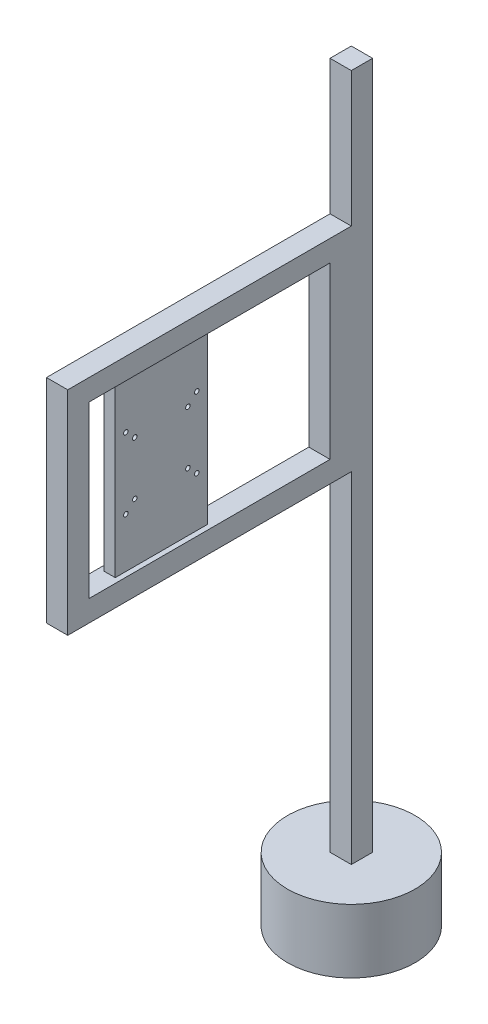
ISO-10303-21;
HEADER;
FILE_DESCRIPTION(('STEP AP214'),'2;1');
FILE_NAME('part.step','',(''),(''),'','','');
FILE_SCHEMA(('AUTOMOTIVE_DESIGN { 1 0 10303 214 1 1 1 1 }'));
ENDSEC;
DATA;
#1=APPLICATION_CONTEXT('core data for automotive mechanical design processes');
#2=APPLICATION_PROTOCOL_DEFINITION('international standard','automotive_design',2000,#1);
#3=PRODUCT_CONTEXT('',#1,'mechanical');
#4=PRODUCT('Part','Part','',(#3));
#5=PRODUCT_RELATED_PRODUCT_CATEGORY('part','',(#4));
#6=PRODUCT_DEFINITION_FORMATION('','',#4);
#7=PRODUCT_DEFINITION_CONTEXT('part definition',#1,'design');
#8=PRODUCT_DEFINITION('design','',#6,#7);
#9=PRODUCT_DEFINITION_SHAPE('','',#8);
#10=(LENGTH_UNIT() NAMED_UNIT(*) SI_UNIT(.MILLI.,.METRE.));
#11=(NAMED_UNIT(*) PLANE_ANGLE_UNIT() SI_UNIT($,.RADIAN.));
#12=(NAMED_UNIT(*) SI_UNIT($,.STERADIAN.) SOLID_ANGLE_UNIT());
#13=UNCERTAINTY_MEASURE_WITH_UNIT(LENGTH_MEASURE(1.E-05),#10,'distance_accuracy_value','');
#14=(GEOMETRIC_REPRESENTATION_CONTEXT(3) GLOBAL_UNCERTAINTY_ASSIGNED_CONTEXT((#13)) GLOBAL_UNIT_ASSIGNED_CONTEXT((#10,
#11,#12)) REPRESENTATION_CONTEXT('',''));
#15=CARTESIAN_POINT('',(0.,0.,0.));
#16=DIRECTION('',(0.,0.,1.));
#17=DIRECTION('',(1.,0.,0.));
#18=AXIS2_PLACEMENT_3D('',#15,#16,#17);
#19=CARTESIAN_POINT('',(15.,840.,341.));
#20=DIRECTION('',(0.,0.,1.));
#21=DIRECTION('',(0.,-1.,0.));
#22=AXIS2_PLACEMENT_3D('',#19,#20,#21);
#23=PLANE('',#22);
#24=DIRECTION('',(-1.,0.,0.));
#25=VECTOR('',#24,1.);
#26=CARTESIAN_POINT('',(15.,600.,341.));
#27=LINE('',#26,#25);
#28=CARTESIAN_POINT('',(8.,600.,341.));
#29=VERTEX_POINT('',#28);
#30=CARTESIAN_POINT('',(-8.,600.,341.));
#31=VERTEX_POINT('',#30);
#32=EDGE_CURVE('E181',#29,#31,#27,.T.);
#33=ORIENTED_EDGE('',*,*,#32,.F.);
#34=DIRECTION('',(0.,-1.,0.));
#35=VECTOR('',#34,1.);
#36=CARTESIAN_POINT('',(8.,840.,341.));
#37=LINE('',#36,#35);
#38=CARTESIAN_POINT('',(8.,840.,341.));
#39=VERTEX_POINT('',#38);
#40=EDGE_CURVE('E187',#39,#29,#37,.T.);
#41=ORIENTED_EDGE('',*,*,#40,.F.);
#42=DIRECTION('',(-1.,0.,0.));
#43=VECTOR('',#42,1.);
#44=CARTESIAN_POINT('',(15.,840.,341.));
#45=LINE('',#44,#43);
#46=CARTESIAN_POINT('',(-8.,840.,341.));
#47=VERTEX_POINT('',#46);
#48=EDGE_CURVE('E207',#39,#47,#45,.T.);
#49=ORIENTED_EDGE('',*,*,#48,.T.);
#50=DIRECTION('',(0.,1.,0.));
#51=VECTOR('',#50,1.);
#52=CARTESIAN_POINT('',(-8.,840.,341.));
#53=LINE('',#52,#51);
#54=EDGE_CURVE('E196',#31,#47,#53,.T.);
#55=ORIENTED_EDGE('',*,*,#54,.F.);
#56=EDGE_LOOP('',(#33,#41,#49,#55));
#57=FACE_BOUND('',#56,.T.);
#58=ADVANCED_FACE('F32',(#57),#23,.T.);
#59=CARTESIAN_POINT('',(15.,840.,211.));
#60=DIRECTION('',(0.,0.,-1.));
#61=DIRECTION('',(0.,1.,0.));
#62=AXIS2_PLACEMENT_3D('',#59,#60,#61);
#63=PLANE('',#62);
#64=DIRECTION('',(-1.,0.,0.));
#65=VECTOR('',#64,1.);
#66=CARTESIAN_POINT('',(15.,840.,211.));
#67=LINE('',#66,#65);
#68=CARTESIAN_POINT('',(8.,840.,211.));
#69=VERTEX_POINT('',#68);
#70=CARTESIAN_POINT('',(-8.,840.,211.));
#71=VERTEX_POINT('',#70);
#72=EDGE_CURVE('E53',#69,#71,#67,.T.);
#73=ORIENTED_EDGE('',*,*,#72,.F.);
#74=DIRECTION('',(0.,1.,0.));
#75=VECTOR('',#74,1.);
#76=CARTESIAN_POINT('',(8.,840.,211.));
#77=LINE('',#76,#75);
#78=CARTESIAN_POINT('',(8.,600.,211.));
#79=VERTEX_POINT('',#78);
#80=EDGE_CURVE('E186',#79,#69,#77,.T.);
#81=ORIENTED_EDGE('',*,*,#80,.F.);
#82=DIRECTION('',(-1.,0.,0.));
#83=VECTOR('',#82,1.);
#84=CARTESIAN_POINT('',(15.,600.,211.));
#85=LINE('',#84,#83);
#86=CARTESIAN_POINT('',(-8.,600.,211.));
#87=VERTEX_POINT('',#86);
#88=EDGE_CURVE('E183',#79,#87,#85,.T.);
#89=ORIENTED_EDGE('',*,*,#88,.T.);
#90=DIRECTION('',(0.,-1.,0.));
#91=VECTOR('',#90,1.);
#92=CARTESIAN_POINT('',(-8.,840.,211.));
#93=LINE('',#92,#91);
#94=EDGE_CURVE('E757',#71,#87,#93,.T.);
#95=ORIENTED_EDGE('',*,*,#94,.F.);
#96=EDGE_LOOP('',(#73,#81,#89,#95));
#97=FACE_BOUND('',#96,.T.);
#98=ADVANCED_FACE('F405',(#97),#63,.T.);
#99=CARTESIAN_POINT('',(15.,757.5,313.5));
#100=DIRECTION('',(-1.,0.,0.));
#101=DIRECTION('',(0.,0.,1.));
#102=AXIS2_PLACEMENT_3D('',#99,#100,#101);
#103=CYLINDRICAL_SURFACE('',#102,3.17499999999997);
#104=CARTESIAN_POINT('',(-8.,757.5,313.5));
#105=DIRECTION('',(-1.,0.,0.));
#106=DIRECTION('',(0.,0.,1.));
#107=AXIS2_PLACEMENT_3D('',#104,#105,#106);
#108=CIRCLE('',#107,3.17499999999997);
#109=CARTESIAN_POINT('',(-8.,757.5,316.675));
#110=VERTEX_POINT('',#109);
#111=EDGE_CURVE('E203',#110,#110,#108,.F.);
#112=ORIENTED_EDGE('',*,*,#111,.F.);
#113=EDGE_LOOP('',(#112));
#114=FACE_BOUND('',#113,.T.);
#115=CARTESIAN_POINT('',(8.,757.5,313.5));
#116=DIRECTION('',(1.,0.,0.));
#117=DIRECTION('',(0.,0.,-1.));
#118=AXIS2_PLACEMENT_3D('',#115,#116,#117);
#119=CIRCLE('',#118,3.17499999999997);
#120=CARTESIAN_POINT('',(8.,757.5,310.325));
#121=VERTEX_POINT('',#120);
#122=EDGE_CURVE('E754',#121,#121,#119,.F.);
#123=ORIENTED_EDGE('',*,*,#122,.F.);
#124=EDGE_LOOP('',(#123));
#125=FACE_BOUND('',#124,.T.);
#126=ADVANCED_FACE('F410',(#114,#125),#103,.F.);
#127=CARTESIAN_POINT('',(15.,757.5,238.5));
#128=DIRECTION('',(-1.,0.,0.));
#129=DIRECTION('',(0.,0.,1.));
#130=AXIS2_PLACEMENT_3D('',#127,#128,#129);
#131=CYLINDRICAL_SURFACE('',#130,3.17499999999997);
#132=CARTESIAN_POINT('',(-8.,757.5,238.5));
#133=DIRECTION('',(-1.,0.,0.));
#134=DIRECTION('',(0.,0.,1.));
#135=AXIS2_PLACEMENT_3D('',#132,#133,#134);
#136=CIRCLE('',#135,3.17499999999997);
#137=CARTESIAN_POINT('',(-8.,757.5,241.675));
#138=VERTEX_POINT('',#137);
#139=EDGE_CURVE('E779',#138,#138,#136,.F.);
#140=ORIENTED_EDGE('',*,*,#139,.F.);
#141=EDGE_LOOP('',(#140));
#142=FACE_BOUND('',#141,.T.);
#143=CARTESIAN_POINT('',(8.,757.5,238.5));
#144=DIRECTION('',(1.,0.,0.));
#145=DIRECTION('',(0.,0.,-1.));
#146=AXIS2_PLACEMENT_3D('',#143,#144,#145);
#147=CIRCLE('',#146,3.17499999999997);
#148=CARTESIAN_POINT('',(8.,757.5,235.325));
#149=VERTEX_POINT('',#148);
#150=EDGE_CURVE('E751',#149,#149,#147,.F.);
#151=ORIENTED_EDGE('',*,*,#150,.F.);
#152=EDGE_LOOP('',(#151));
#153=FACE_BOUND('',#152,.T.);
#154=ADVANCED_FACE('F499',(#142,#153),#131,.F.);
#155=CARTESIAN_POINT('',(15.,682.5,238.5));
#156=DIRECTION('',(-1.,0.,0.));
#157=DIRECTION('',(0.,0.,1.));
#158=AXIS2_PLACEMENT_3D('',#155,#156,#157);
#159=CYLINDRICAL_SURFACE('',#158,3.17499999999997);
#160=CARTESIAN_POINT('',(-8.,682.5,238.5));
#161=DIRECTION('',(-1.,0.,0.));
#162=DIRECTION('',(0.,0.,1.));
#163=AXIS2_PLACEMENT_3D('',#160,#161,#162);
#164=CIRCLE('',#163,3.17499999999997);
#165=CARTESIAN_POINT('',(-8.,682.5,241.675));
#166=VERTEX_POINT('',#165);
#167=EDGE_CURVE('E777',#166,#166,#164,.F.);
#168=ORIENTED_EDGE('',*,*,#167,.F.);
#169=EDGE_LOOP('',(#168));
#170=FACE_BOUND('',#169,.T.);
#171=CARTESIAN_POINT('',(8.,682.5,238.5));
#172=DIRECTION('',(1.,0.,0.));
#173=DIRECTION('',(0.,0.,-1.));
#174=AXIS2_PLACEMENT_3D('',#171,#172,#173);
#175=CIRCLE('',#174,3.17499999999997);
#176=CARTESIAN_POINT('',(8.,682.5,235.325));
#177=VERTEX_POINT('',#176);
#178=EDGE_CURVE('E748',#177,#177,#175,.F.);
#179=ORIENTED_EDGE('',*,*,#178,.F.);
#180=EDGE_LOOP('',(#179));
#181=FACE_BOUND('',#180,.T.);
#182=ADVANCED_FACE('F507',(#170,#181),#159,.F.);
#183=CARTESIAN_POINT('',(15.,682.5,313.5));
#184=DIRECTION('',(-1.,0.,0.));
#185=DIRECTION('',(0.,0.,1.));
#186=AXIS2_PLACEMENT_3D('',#183,#184,#185);
#187=CYLINDRICAL_SURFACE('',#186,3.17499999999997);
#188=CARTESIAN_POINT('',(-8.,682.5,313.5));
#189=DIRECTION('',(-1.,0.,0.));
#190=DIRECTION('',(0.,0.,1.));
#191=AXIS2_PLACEMENT_3D('',#188,#189,#190);
#192=CIRCLE('',#191,3.17499999999997);
#193=CARTESIAN_POINT('',(-8.,682.5,316.675));
#194=VERTEX_POINT('',#193);
#195=EDGE_CURVE('E774',#194,#194,#192,.F.);
#196=ORIENTED_EDGE('',*,*,#195,.F.);
#197=EDGE_LOOP('',(#196));
#198=FACE_BOUND('',#197,.T.);
#199=CARTESIAN_POINT('',(8.,682.5,313.5));
#200=DIRECTION('',(1.,0.,0.));
#201=DIRECTION('',(0.,0.,-1.));
#202=AXIS2_PLACEMENT_3D('',#199,#200,#201);
#203=CIRCLE('',#202,3.17499999999997);
#204=CARTESIAN_POINT('',(8.,682.5,310.325));
#205=VERTEX_POINT('',#204);
#206=EDGE_CURVE('E745',#205,#205,#203,.F.);
#207=ORIENTED_EDGE('',*,*,#206,.F.);
#208=EDGE_LOOP('',(#207));
#209=FACE_BOUND('',#208,.T.);
#210=ADVANCED_FACE('F516',(#198,#209),#187,.F.);
#211=CARTESIAN_POINT('',(15.,770.,326.));
#212=DIRECTION('',(-1.,0.,0.));
#213=DIRECTION('',(0.,0.,1.));
#214=AXIS2_PLACEMENT_3D('',#211,#212,#213);
#215=CYLINDRICAL_SURFACE('',#214,3.17499999999997);
#216=CARTESIAN_POINT('',(-8.,770.,326.));
#217=DIRECTION('',(-1.,0.,0.));
#218=DIRECTION('',(0.,0.,1.));
#219=AXIS2_PLACEMENT_3D('',#216,#217,#218);
#220=CIRCLE('',#219,3.17499999999997);
#221=CARTESIAN_POINT('',(-8.,770.,329.175));
#222=VERTEX_POINT('',#221);
#223=EDGE_CURVE('E771',#222,#222,#220,.F.);
#224=ORIENTED_EDGE('',*,*,#223,.F.);
#225=EDGE_LOOP('',(#224));
#226=FACE_BOUND('',#225,.T.);
#227=CARTESIAN_POINT('',(8.,770.,326.));
#228=DIRECTION('',(1.,0.,0.));
#229=DIRECTION('',(0.,0.,-1.));
#230=AXIS2_PLACEMENT_3D('',#227,#228,#229);
#231=CIRCLE('',#230,3.17499999999997);
#232=CARTESIAN_POINT('',(8.,770.,322.825));
#233=VERTEX_POINT('',#232);
#234=EDGE_CURVE('E742',#233,#233,#231,.F.);
#235=ORIENTED_EDGE('',*,*,#234,.F.);
#236=EDGE_LOOP('',(#235));
#237=FACE_BOUND('',#236,.T.);
#238=ADVANCED_FACE('F525',(#226,#237),#215,.F.);
#239=CARTESIAN_POINT('',(15.,770.,226.));
#240=DIRECTION('',(-1.,0.,0.));
#241=DIRECTION('',(0.,0.,1.));
#242=AXIS2_PLACEMENT_3D('',#239,#240,#241);
#243=CYLINDRICAL_SURFACE('',#242,3.17499999999997);
#244=CARTESIAN_POINT('',(-8.,770.,226.));
#245=DIRECTION('',(-1.,0.,0.));
#246=DIRECTION('',(0.,0.,1.));
#247=AXIS2_PLACEMENT_3D('',#244,#245,#246);
#248=CIRCLE('',#247,3.17499999999997);
#249=CARTESIAN_POINT('',(-8.,770.,229.175));
#250=VERTEX_POINT('',#249);
#251=EDGE_CURVE('E768',#250,#250,#248,.F.);
#252=ORIENTED_EDGE('',*,*,#251,.F.);
#253=EDGE_LOOP('',(#252));
#254=FACE_BOUND('',#253,.T.);
#255=CARTESIAN_POINT('',(8.,770.,226.));
#256=DIRECTION('',(1.,0.,0.));
#257=DIRECTION('',(0.,0.,-1.));
#258=AXIS2_PLACEMENT_3D('',#255,#256,#257);
#259=CIRCLE('',#258,3.17499999999997);
#260=CARTESIAN_POINT('',(8.,770.,222.825));
#261=VERTEX_POINT('',#260);
#262=EDGE_CURVE('E735',#261,#261,#259,.F.);
#263=ORIENTED_EDGE('',*,*,#262,.F.);
#264=EDGE_LOOP('',(#263));
#265=FACE_BOUND('',#264,.T.);
#266=ADVANCED_FACE('F534',(#254,#265),#243,.F.);
#267=CARTESIAN_POINT('',(15.,670.,326.));
#268=DIRECTION('',(-1.,0.,0.));
#269=DIRECTION('',(0.,0.,1.));
#270=AXIS2_PLACEMENT_3D('',#267,#268,#269);
#271=CYLINDRICAL_SURFACE('',#270,3.17499999999997);
#272=CARTESIAN_POINT('',(-8.,670.,326.));
#273=DIRECTION('',(-1.,0.,0.));
#274=DIRECTION('',(0.,0.,1.));
#275=AXIS2_PLACEMENT_3D('',#272,#273,#274);
#276=CIRCLE('',#275,3.17499999999997);
#277=CARTESIAN_POINT('',(-8.,670.,329.175));
#278=VERTEX_POINT('',#277);
#279=EDGE_CURVE('E765',#278,#278,#276,.F.);
#280=ORIENTED_EDGE('',*,*,#279,.F.);
#281=EDGE_LOOP('',(#280));
#282=FACE_BOUND('',#281,.T.);
#283=CARTESIAN_POINT('',(8.,670.,326.));
#284=DIRECTION('',(1.,0.,0.));
#285=DIRECTION('',(0.,0.,-1.));
#286=AXIS2_PLACEMENT_3D('',#283,#284,#285);
#287=CIRCLE('',#286,3.17499999999997);
#288=CARTESIAN_POINT('',(8.,670.,322.825));
#289=VERTEX_POINT('',#288);
#290=EDGE_CURVE('E732',#289,#289,#287,.F.);
#291=ORIENTED_EDGE('',*,*,#290,.F.);
#292=EDGE_LOOP('',(#291));
#293=FACE_BOUND('',#292,.T.);
#294=ADVANCED_FACE('F543',(#282,#293),#271,.F.);
#295=CARTESIAN_POINT('',(15.,670.,226.));
#296=DIRECTION('',(-1.,0.,0.));
#297=DIRECTION('',(0.,0.,1.));
#298=AXIS2_PLACEMENT_3D('',#295,#296,#297);
#299=CYLINDRICAL_SURFACE('',#298,3.17499999999997);
#300=CARTESIAN_POINT('',(-8.,670.,226.));
#301=DIRECTION('',(-1.,0.,0.));
#302=DIRECTION('',(0.,0.,1.));
#303=AXIS2_PLACEMENT_3D('',#300,#301,#302);
#304=CIRCLE('',#303,3.17499999999997);
#305=CARTESIAN_POINT('',(-8.,670.,229.175));
#306=VERTEX_POINT('',#305);
#307=EDGE_CURVE('E36',#306,#306,#304,.F.);
#308=ORIENTED_EDGE('',*,*,#307,.F.);
#309=EDGE_LOOP('',(#308));
#310=FACE_BOUND('',#309,.T.);
#311=CARTESIAN_POINT('',(8.,670.,226.));
#312=DIRECTION('',(1.,0.,0.));
#313=DIRECTION('',(0.,0.,-1.));
#314=AXIS2_PLACEMENT_3D('',#311,#312,#313);
#315=CIRCLE('',#314,3.17499999999997);
#316=CARTESIAN_POINT('',(8.,670.,222.825));
#317=VERTEX_POINT('',#316);
#318=EDGE_CURVE('E730',#317,#317,#315,.F.);
#319=ORIENTED_EDGE('',*,*,#318,.F.);
#320=EDGE_LOOP('',(#319));
#321=FACE_BOUND('',#320,.T.);
#322=ADVANCED_FACE('F552',(#310,#321),#299,.F.);
#323=CARTESIAN_POINT('',(-15.,1060.,15.));
#324=DIRECTION('',(0.,0.,-1.));
#325=DIRECTION('',(-1.,0.,0.));
#326=AXIS2_PLACEMENT_3D('',#323,#324,#325);
#327=PLANE('',#326);
#328=DIRECTION('',(0.,-1.,0.));
#329=VECTOR('',#328,1.);
#330=CARTESIAN_POINT('',(15.,1060.,15.));
#331=LINE('',#330,#329);
#332=CARTESIAN_POINT('',(15.,570.,15.));
#333=VERTEX_POINT('',#332);
#334=CARTESIAN_POINT('',(15.,90.,15.));
#335=VERTEX_POINT('',#334);
#336=EDGE_CURVE('E300',#333,#335,#331,.T.);
#337=ORIENTED_EDGE('',*,*,#336,.F.);
#338=DIRECTION('',(1.,0.,0.));
#339=VECTOR('',#338,1.);
#340=CARTESIAN_POINT('',(-15.,570.,15.));
#341=LINE('',#340,#339);
#342=CARTESIAN_POINT('',(-15.,570.,15.));
#343=VERTEX_POINT('',#342);
#344=EDGE_CURVE('E253',#343,#333,#341,.T.);
#345=ORIENTED_EDGE('',*,*,#344,.F.);
#346=DIRECTION('',(0.,-1.,0.));
#347=VECTOR('',#346,1.);
#348=CARTESIAN_POINT('',(-15.,1060.,15.));
#349=LINE('',#348,#347);
#350=CARTESIAN_POINT('',(-15.,90.,15.));
#351=VERTEX_POINT('',#350);
#352=EDGE_CURVE('E314',#343,#351,#349,.T.);
#353=ORIENTED_EDGE('',*,*,#352,.T.);
#354=DIRECTION('',(1.,0.,0.));
#355=VECTOR('',#354,1.);
#356=CARTESIAN_POINT('',(-15.,90.,15.));
#357=LINE('',#356,#355);
#358=EDGE_CURVE('E294',#351,#335,#357,.T.);
#359=ORIENTED_EDGE('',*,*,#358,.T.);
#360=EDGE_LOOP('',(#337,#345,#353,#359));
#361=FACE_BOUND('',#360,.T.);
#362=ADVANCED_FACE('F368',(#361),#327,.F.);
#363=CARTESIAN_POINT('',(-15.,1060.,-15.));
#364=DIRECTION('',(0.,0.,1.));
#365=DIRECTION('',(1.,0.,0.));
#366=AXIS2_PLACEMENT_3D('',#363,#364,#365);
#367=PLANE('',#366);
#368=DIRECTION('',(1.,0.,0.));
#369=VECTOR('',#368,1.);
#370=CARTESIAN_POINT('',(-15.,210.,-15.));
#371=LINE('',#370,#369);
#372=CARTESIAN_POINT('',(-15.,210.,-15.));
#373=VERTEX_POINT('',#372);
#374=CARTESIAN_POINT('',(6.21320343559641,210.,-15.));
#375=VERTEX_POINT('',#374);
#376=EDGE_CURVE('E286',#373,#375,#371,.T.);
#377=ORIENTED_EDGE('',*,*,#376,.F.);
#378=DIRECTION('',(0.,-1.,0.));
#379=VECTOR('',#378,1.);
#380=CARTESIAN_POINT('',(-15.,1060.,-15.));
#381=LINE('',#380,#379);
#382=CARTESIAN_POINT('',(-15.,1060.,-15.));
#383=VERTEX_POINT('',#382);
#384=EDGE_CURVE('E319',#383,#373,#381,.T.);
#385=ORIENTED_EDGE('',*,*,#384,.F.);
#386=DIRECTION('',(-1.,0.,0.));
#387=VECTOR('',#386,1.);
#388=CARTESIAN_POINT('',(-15.,1060.,-15.));
#389=LINE('',#388,#387);
#390=CARTESIAN_POINT('',(15.,1060.,-15.));
#391=VERTEX_POINT('',#390);
#392=EDGE_CURVE('E293',#391,#383,#389,.T.);
#393=ORIENTED_EDGE('',*,*,#392,.F.);
#394=DIRECTION('',(0.,-1.,0.));
#395=VECTOR('',#394,1.);
#396=CARTESIAN_POINT('',(15.,1060.,-15.));
#397=LINE('',#396,#395);
#398=CARTESIAN_POINT('',(15.,90.,-15.));
#399=VERTEX_POINT('',#398);
#400=EDGE_CURVE('E322',#391,#399,#397,.T.);
#401=ORIENTED_EDGE('',*,*,#400,.T.);
#402=DIRECTION('',(-1.,0.,0.));
#403=VECTOR('',#402,1.);
#404=CARTESIAN_POINT('',(-15.,90.,-15.));
#405=LINE('',#404,#403);
#406=CARTESIAN_POINT('',(-15.,90.,-15.));
#407=VERTEX_POINT('',#406);
#408=EDGE_CURVE('E303',#399,#407,#405,.T.);
#409=ORIENTED_EDGE('',*,*,#408,.T.);
#410=CARTESIAN_POINT('',(-15.,180.,-15.));
#411=VERTEX_POINT('',#410);
#412=EDGE_CURVE('E318',#411,#407,#381,.T.);
#413=ORIENTED_EDGE('',*,*,#412,.F.);
#414=DIRECTION('',(-1.,0.,0.));
#415=VECTOR('',#414,1.);
#416=CARTESIAN_POINT('',(-15.,180.,-15.));
#417=LINE('',#416,#415);
#418=CARTESIAN_POINT('',(6.21320343559642,180.,-15.));
#419=VERTEX_POINT('',#418);
#420=EDGE_CURVE('E283',#419,#411,#417,.T.);
#421=ORIENTED_EDGE('',*,*,#420,.F.);
#422=DIRECTION('',(0.,-1.,0.));
#423=VECTOR('',#422,1.);
#424=CARTESIAN_POINT('',(6.21320343559641,1060.,-15.));
#425=LINE('',#424,#423);
#426=EDGE_CURVE('E11',#375,#419,#425,.T.);
#427=ORIENTED_EDGE('',*,*,#426,.F.);
#428=EDGE_LOOP('',(#377,#385,#393,#401,#409,#413,#421,#427));
#429=FACE_BOUND('',#428,.T.);
#430=ADVANCED_FACE('F354',(#429),#367,.F.);
#431=CARTESIAN_POINT('',(-15.,1060.,15.));
#432=DIRECTION('',(1.,0.,0.));
#433=DIRECTION('',(0.,0.,-1.));
#434=AXIS2_PLACEMENT_3D('',#431,#432,#433);
#435=PLANE('',#434);
#436=DIRECTION('',(0.,0.,1.));
#437=VECTOR('',#436,1.);
#438=CARTESIAN_POINT('',(-15.,840.,45.));
#439=LINE('',#438,#437);
#440=CARTESIAN_POINT('',(-15.,840.,45.));
#441=VERTEX_POINT('',#440);
#442=CARTESIAN_POINT('',(-15.,840.,385.));
#443=VERTEX_POINT('',#442);
#444=EDGE_CURVE('E212',#441,#443,#439,.T.);
#445=ORIENTED_EDGE('',*,*,#444,.T.);
#446=DIRECTION('',(0.,-1.,0.));
#447=VECTOR('',#446,1.);
#448=CARTESIAN_POINT('',(-15.,840.,385.));
#449=LINE('',#448,#447);
#450=CARTESIAN_POINT('',(-15.,600.,385.));
#451=VERTEX_POINT('',#450);
#452=EDGE_CURVE('E215',#443,#451,#449,.T.);
#453=ORIENTED_EDGE('',*,*,#452,.T.);
#454=DIRECTION('',(0.,0.,-1.));
#455=VECTOR('',#454,1.);
#456=CARTESIAN_POINT('',(-15.,600.,45.));
#457=LINE('',#456,#455);
#458=CARTESIAN_POINT('',(-15.,600.,45.));
#459=VERTEX_POINT('',#458);
#460=EDGE_CURVE('E218',#451,#459,#457,.T.);
#461=ORIENTED_EDGE('',*,*,#460,.T.);
#462=DIRECTION('',(0.,1.,0.));
#463=VECTOR('',#462,1.);
#464=CARTESIAN_POINT('',(-15.,840.,45.));
#465=LINE('',#464,#463);
#466=EDGE_CURVE('E209',#459,#441,#465,.T.);
#467=ORIENTED_EDGE('',*,*,#466,.T.);
#468=EDGE_LOOP('',(#445,#453,#461,#467));
#469=FACE_BOUND('',#468,.T.);
#470=DIRECTION('',(0.,0.,-1.));
#471=VECTOR('',#470,1.);
#472=CARTESIAN_POINT('',(-15.,210.,15.));
#473=LINE('',#472,#471);
#474=CARTESIAN_POINT('',(-15.,210.,6.21320343559638));
#475=VERTEX_POINT('',#474);
#476=EDGE_CURVE('E41',#475,#373,#473,.T.);
#477=ORIENTED_EDGE('',*,*,#476,.F.);
#478=DIRECTION('',(0.,1.,0.));
#479=VECTOR('',#478,1.);
#480=CARTESIAN_POINT('',(-15.,1060.,6.21320343559638));
#481=LINE('',#480,#479);
#482=CARTESIAN_POINT('',(-15.,180.,6.21320343559645));
#483=VERTEX_POINT('',#482);
#484=EDGE_CURVE('E333',#483,#475,#481,.T.);
#485=ORIENTED_EDGE('',*,*,#484,.F.);
#486=DIRECTION('',(0.,0.,1.));
#487=VECTOR('',#486,1.);
#488=CARTESIAN_POINT('',(-15.,180.,15.));
#489=LINE('',#488,#487);
#490=EDGE_CURVE('E328',#411,#483,#489,.T.);
#491=ORIENTED_EDGE('',*,*,#490,.F.);
#492=ORIENTED_EDGE('',*,*,#412,.T.);
#493=DIRECTION('',(0.,0.,1.));
#494=VECTOR('',#493,1.);
#495=CARTESIAN_POINT('',(-15.,90.,15.));
#496=LINE('',#495,#494);
#497=EDGE_CURVE('E306',#407,#351,#496,.T.);
#498=ORIENTED_EDGE('',*,*,#497,.T.);
#499=ORIENTED_EDGE('',*,*,#352,.F.);
#500=DIRECTION('',(0.,0.,-1.));
#501=VECTOR('',#500,1.);
#502=CARTESIAN_POINT('',(-15.,570.,15.));
#503=LINE('',#502,#501);
#504=CARTESIAN_POINT('',(-15.,570.,415.));
#505=VERTEX_POINT('',#504);
#506=EDGE_CURVE('E244',#505,#343,#503,.T.);
#507=ORIENTED_EDGE('',*,*,#506,.F.);
#508=DIRECTION('',(0.,-1.,0.));
#509=VECTOR('',#508,1.);
#510=CARTESIAN_POINT('',(-15.,870.,415.));
#511=LINE('',#510,#509);
#512=CARTESIAN_POINT('',(-15.,870.,415.));
#513=VERTEX_POINT('',#512);
#514=EDGE_CURVE('E240',#513,#505,#511,.T.);
#515=ORIENTED_EDGE('',*,*,#514,.F.);
#516=DIRECTION('',(0.,0.,1.));
#517=VECTOR('',#516,1.);
#518=CARTESIAN_POINT('',(-15.,870.,15.));
#519=LINE('',#518,#517);
#520=CARTESIAN_POINT('',(-15.,870.,15.));
#521=VERTEX_POINT('',#520);
#522=EDGE_CURVE('E237',#521,#513,#519,.T.);
#523=ORIENTED_EDGE('',*,*,#522,.F.);
#524=CARTESIAN_POINT('',(-15.,1060.,15.));
#525=VERTEX_POINT('',#524);
#526=EDGE_CURVE('E315',#525,#521,#349,.T.);
#527=ORIENTED_EDGE('',*,*,#526,.F.);
#528=DIRECTION('',(0.,0.,1.));
#529=VECTOR('',#528,1.);
#530=CARTESIAN_POINT('',(-15.,1060.,15.));
#531=LINE('',#530,#529);
#532=EDGE_CURVE('E296',#383,#525,#531,.T.);
#533=ORIENTED_EDGE('',*,*,#532,.F.);
#534=ORIENTED_EDGE('',*,*,#384,.T.);
#535=EDGE_LOOP('',(#477,#485,#491,#492,#498,#499,#507,#515,#523,#527,#533,#534));
#536=FACE_BOUND('',#535,.T.);
#537=ADVANCED_FACE('F342',(#469,#536),#435,.F.);
#538=CARTESIAN_POINT('',(0.,90.,0.));
#539=DIRECTION('',(0.,1.,0.));
#540=DIRECTION('',(0.,0.,1.));
#541=AXIS2_PLACEMENT_3D('',#538,#539,#540);
#542=PLANE('',#541);
#543=CARTESIAN_POINT('',(0.,90.,0.));
#544=DIRECTION('',(0.,1.,0.));
#545=DIRECTION('',(0.,0.,1.));
#546=AXIS2_PLACEMENT_3D('',#543,#544,#545);
#547=CIRCLE('',#546,90.);
#548=CARTESIAN_POINT('',(0.,90.,90.));
#549=VERTEX_POINT('',#548);
#550=EDGE_CURVE('E325',#549,#549,#547,.T.);
#551=ORIENTED_EDGE('',*,*,#550,.T.);
#552=EDGE_LOOP('',(#551));
#553=FACE_BOUND('',#552,.T.);
#554=ORIENTED_EDGE('',*,*,#408,.F.);
#555=DIRECTION('',(0.,0.,-1.));
#556=VECTOR('',#555,1.);
#557=CARTESIAN_POINT('',(15.,90.,15.));
#558=LINE('',#557,#556);
#559=EDGE_CURVE('E289',#335,#399,#558,.T.);
#560=ORIENTED_EDGE('',*,*,#559,.F.);
#561=ORIENTED_EDGE('',*,*,#358,.F.);
#562=ORIENTED_EDGE('',*,*,#497,.F.);
#563=EDGE_LOOP('',(#554,#560,#561,#562));
#564=FACE_BOUND('',#563,.T.);
#565=ADVANCED_FACE('F361',(#553,#564),#542,.T.);
#566=CARTESIAN_POINT('',(0.,90.,0.));
#567=DIRECTION('',(0.,-1.,0.));
#568=DIRECTION('',(0.,0.,-1.));
#569=AXIS2_PLACEMENT_3D('',#566,#567,#568);
#570=CYLINDRICAL_SURFACE('',#569,90.);
#571=ORIENTED_EDGE('',*,*,#550,.F.);
#572=EDGE_LOOP('',(#571));
#573=FACE_BOUND('',#572,.T.);
#574=CARTESIAN_POINT('',(0.,0.,0.));
#575=DIRECTION('',(0.,1.,0.));
#576=DIRECTION('',(0.,0.,1.));
#577=AXIS2_PLACEMENT_3D('',#574,#575,#576);
#578=CIRCLE('',#577,90.);
#579=CARTESIAN_POINT('',(0.,0.,90.));
#580=VERTEX_POINT('',#579);
#581=EDGE_CURVE('E324',#580,#580,#578,.T.);
#582=ORIENTED_EDGE('',*,*,#581,.T.);
#583=EDGE_LOOP('',(#582));
#584=FACE_BOUND('',#583,.T.);
#585=ADVANCED_FACE('F34',(#573,#584),#570,.T.);
#586=CARTESIAN_POINT('',(0.,0.,0.));
#587=DIRECTION('',(0.,1.,0.));
#588=DIRECTION('',(0.,0.,1.));
#589=AXIS2_PLACEMENT_3D('',#586,#587,#588);
#590=PLANE('',#589);
#591=ORIENTED_EDGE('',*,*,#581,.F.);
#592=EDGE_LOOP('',(#591));
#593=FACE_BOUND('',#592,.T.);
#594=ADVANCED_FACE('F569',(#593),#590,.F.);
#595=CARTESIAN_POINT('',(15.,1060.,15.));
#596=DIRECTION('',(-1.,0.,0.));
#597=DIRECTION('',(0.,0.,1.));
#598=AXIS2_PLACEMENT_3D('',#595,#596,#597);
#599=PLANE('',#598);
#600=ORIENTED_EDGE('',*,*,#559,.T.);
#601=ORIENTED_EDGE('',*,*,#400,.F.);
#602=DIRECTION('',(0.,0.,-1.));
#603=VECTOR('',#602,1.);
#604=CARTESIAN_POINT('',(15.,1060.,15.));
#605=LINE('',#604,#603);
#606=CARTESIAN_POINT('',(15.,1060.,15.));
#607=VERTEX_POINT('',#606);
#608=EDGE_CURVE('E290',#607,#391,#605,.T.);
#609=ORIENTED_EDGE('',*,*,#608,.F.);
#610=CARTESIAN_POINT('',(15.,870.,15.));
#611=VERTEX_POINT('',#610);
#612=EDGE_CURVE('E311',#607,#611,#331,.T.);
#613=ORIENTED_EDGE('',*,*,#612,.T.);
#614=DIRECTION('',(0.,0.,1.));
#615=VECTOR('',#614,1.);
#616=CARTESIAN_POINT('',(15.,870.,15.));
#617=LINE('',#616,#615);
#618=CARTESIAN_POINT('',(15.,870.,415.));
#619=VERTEX_POINT('',#618);
#620=EDGE_CURVE('E229',#611,#619,#617,.T.);
#621=ORIENTED_EDGE('',*,*,#620,.T.);
#622=DIRECTION('',(0.,-1.,0.));
#623=VECTOR('',#622,1.);
#624=CARTESIAN_POINT('',(15.,870.,415.));
#625=LINE('',#624,#623);
#626=CARTESIAN_POINT('',(15.,570.,415.));
#627=VERTEX_POINT('',#626);
#628=EDGE_CURVE('E249',#619,#627,#625,.T.);
#629=ORIENTED_EDGE('',*,*,#628,.T.);
#630=DIRECTION('',(0.,0.,-1.));
#631=VECTOR('',#630,1.);
#632=CARTESIAN_POINT('',(15.,570.,15.));
#633=LINE('',#632,#631);
#634=EDGE_CURVE('E241',#627,#333,#633,.T.);
#635=ORIENTED_EDGE('',*,*,#634,.T.);
#636=ORIENTED_EDGE('',*,*,#336,.T.);
#637=EDGE_LOOP('',(#600,#601,#609,#613,#621,#629,#635,#636));
#638=FACE_BOUND('',#637,.T.);
#639=DIRECTION('',(0.,-1.,0.));
#640=VECTOR('',#639,1.);
#641=CARTESIAN_POINT('',(15.,840.,385.));
#642=LINE('',#641,#640);
#643=CARTESIAN_POINT('',(15.,840.,385.));
#644=VERTEX_POINT('',#643);
#645=CARTESIAN_POINT('',(15.,600.,385.));
#646=VERTEX_POINT('',#645);
#647=EDGE_CURVE('E222',#644,#646,#642,.T.);
#648=ORIENTED_EDGE('',*,*,#647,.F.);
#649=DIRECTION('',(0.,0.,1.));
#650=VECTOR('',#649,1.);
#651=CARTESIAN_POINT('',(15.,840.,45.));
#652=LINE('',#651,#650);
#653=CARTESIAN_POINT('',(15.,840.,45.));
#654=VERTEX_POINT('',#653);
#655=EDGE_CURVE('E199',#654,#644,#652,.T.);
#656=ORIENTED_EDGE('',*,*,#655,.F.);
#657=DIRECTION('',(0.,1.,0.));
#658=VECTOR('',#657,1.);
#659=CARTESIAN_POINT('',(15.,840.,45.));
#660=LINE('',#659,#658);
#661=CARTESIAN_POINT('',(15.,600.,45.));
#662=VERTEX_POINT('',#661);
#663=EDGE_CURVE('E197',#662,#654,#660,.T.);
#664=ORIENTED_EDGE('',*,*,#663,.F.);
#665=DIRECTION('',(0.,0.,-1.));
#666=VECTOR('',#665,1.);
#667=CARTESIAN_POINT('',(15.,600.,45.));
#668=LINE('',#667,#666);
#669=EDGE_CURVE('E213',#646,#662,#668,.T.);
#670=ORIENTED_EDGE('',*,*,#669,.F.);
#671=EDGE_LOOP('',(#648,#656,#664,#670));
#672=FACE_BOUND('',#671,.T.);
#673=ADVANCED_FACE('F385',(#638,#672),#599,.F.);
#674=ORIENTED_EDGE('',*,*,#526,.T.);
#675=DIRECTION('',(1.,0.,0.));
#676=VECTOR('',#675,1.);
#677=CARTESIAN_POINT('',(-15.,870.,15.));
#678=LINE('',#677,#676);
#679=EDGE_CURVE('E246',#521,#611,#678,.T.);
#680=ORIENTED_EDGE('',*,*,#679,.T.);
#681=ORIENTED_EDGE('',*,*,#612,.F.);
#682=DIRECTION('',(1.,0.,0.));
#683=VECTOR('',#682,1.);
#684=CARTESIAN_POINT('',(-15.,1060.,15.));
#685=LINE('',#684,#683);
#686=EDGE_CURVE('E298',#525,#607,#685,.T.);
#687=ORIENTED_EDGE('',*,*,#686,.F.);
#688=EDGE_LOOP('',(#674,#680,#681,#687));
#689=FACE_BOUND('',#688,.T.);
#690=ADVANCED_FACE('F381',(#689),#327,.F.);
#691=CARTESIAN_POINT('',(15.,1060.,-15.));
#692=DIRECTION('',(0.,-1.,0.));
#693=DIRECTION('',(0.,0.,-1.));
#694=AXIS2_PLACEMENT_3D('',#691,#692,#693);
#695=PLANE('',#694);
#696=ORIENTED_EDGE('',*,*,#608,.T.);
#697=ORIENTED_EDGE('',*,*,#392,.T.);
#698=ORIENTED_EDGE('',*,*,#532,.T.);
#699=ORIENTED_EDGE('',*,*,#686,.T.);
#700=EDGE_LOOP('',(#696,#697,#698,#699));
#701=FACE_BOUND('',#700,.T.);
#702=ADVANCED_FACE('F388',(#701),#695,.F.);
#703=CARTESIAN_POINT('',(-130.814754519511,180.,-152.027957955108));
#704=DIRECTION('',(-0.707106781186547,0.,0.707106781186548));
#705=DIRECTION('',(0.707106781186548,0.,0.707106781186547));
#706=AXIS2_PLACEMENT_3D('',#703,#704,#705);
#707=PLANE('',#706);
#708=DIRECTION('',(0.707106781186548,0.,0.707106781186547));
#709=VECTOR('',#708,1.);
#710=CARTESIAN_POINT('',(-130.814754519511,210.,-152.027957955108));
#711=LINE('',#710,#709);
#712=CARTESIAN_POINT('',(-130.814754519511,210.,-152.027957955108));
#713=VERTEX_POINT('',#712);
#714=EDGE_CURVE('E277',#713,#375,#711,.T.);
#715=ORIENTED_EDGE('',*,*,#714,.T.);
#716=ORIENTED_EDGE('',*,*,#426,.T.);
#717=DIRECTION('',(0.707106781186548,0.,0.707106781186547));
#718=VECTOR('',#717,1.);
#719=CARTESIAN_POINT('',(-130.814754519511,180.,-152.027957955108));
#720=LINE('',#719,#718);
#721=CARTESIAN_POINT('',(-130.814754519511,180.,-152.027957955108));
#722=VERTEX_POINT('',#721);
#723=EDGE_CURVE('E274',#722,#419,#720,.T.);
#724=ORIENTED_EDGE('',*,*,#723,.F.);
#725=DIRECTION('',(0.,-1.,0.));
#726=VECTOR('',#725,1.);
#727=CARTESIAN_POINT('',(-130.814754519511,180.,-152.027957955108));
#728=LINE('',#727,#726);
#729=EDGE_CURVE('E267',#713,#722,#728,.T.);
#730=ORIENTED_EDGE('',*,*,#729,.F.);
#731=EDGE_LOOP('',(#715,#716,#724,#730));
#732=FACE_BOUND('',#731,.T.);
#733=ADVANCED_FACE('F391',(#732),#707,.F.);
#734=CARTESIAN_POINT('',(-152.027957955108,180.,-130.814754519511));
#735=DIRECTION('',(0.707106781186547,0.,-0.707106781186548));
#736=DIRECTION('',(-0.707106781186548,0.,-0.707106781186547));
#737=AXIS2_PLACEMENT_3D('',#734,#735,#736);
#738=PLANE('',#737);
#739=DIRECTION('',(0.707106781186548,0.,0.707106781186547));
#740=VECTOR('',#739,1.);
#741=CARTESIAN_POINT('',(-152.027957955108,180.,-130.814754519511));
#742=LINE('',#741,#740);
#743=CARTESIAN_POINT('',(-152.027957955108,180.,-130.814754519511));
#744=VERTEX_POINT('',#743);
#745=EDGE_CURVE('E271',#744,#483,#742,.T.);
#746=ORIENTED_EDGE('',*,*,#745,.T.);
#747=ORIENTED_EDGE('',*,*,#484,.T.);
#748=DIRECTION('',(0.707106781186548,0.,0.707106781186547));
#749=VECTOR('',#748,1.);
#750=CARTESIAN_POINT('',(-152.027957955108,210.,-130.814754519511));
#751=LINE('',#750,#749);
#752=CARTESIAN_POINT('',(-152.027957955108,210.,-130.814754519511));
#753=VERTEX_POINT('',#752);
#754=EDGE_CURVE('E280',#753,#475,#751,.T.);
#755=ORIENTED_EDGE('',*,*,#754,.F.);
#756=DIRECTION('',(0.,1.,0.));
#757=VECTOR('',#756,1.);
#758=CARTESIAN_POINT('',(-152.027957955108,180.,-130.814754519511));
#759=LINE('',#758,#757);
#760=EDGE_CURVE('E256',#744,#753,#759,.T.);
#761=ORIENTED_EDGE('',*,*,#760,.F.);
#762=EDGE_LOOP('',(#746,#747,#755,#761));
#763=FACE_BOUND('',#762,.T.);
#764=ADVANCED_FACE('F346',(#763),#738,.F.);
#765=CARTESIAN_POINT('',(-130.814754519511,210.,-152.027957955108));
#766=DIRECTION('',(0.,-1.,0.));
#767=DIRECTION('',(0.,0.,-1.));
#768=AXIS2_PLACEMENT_3D('',#765,#766,#767);
#769=PLANE('',#768);
#770=ORIENTED_EDGE('',*,*,#476,.T.);
#771=ORIENTED_EDGE('',*,*,#376,.T.);
#772=ORIENTED_EDGE('',*,*,#714,.F.);
#773=DIRECTION('',(0.707106781186547,0.,-0.707106781186548));
#774=VECTOR('',#773,1.);
#775=CARTESIAN_POINT('',(-130.814754519511,210.,-152.027957955108));
#776=LINE('',#775,#774);
#777=EDGE_CURVE('E265',#753,#713,#776,.T.);
#778=ORIENTED_EDGE('',*,*,#777,.F.);
#779=ORIENTED_EDGE('',*,*,#754,.T.);
#780=EDGE_LOOP('',(#770,#771,#772,#778,#779));
#781=FACE_BOUND('',#780,.T.);
#782=ADVANCED_FACE('F338',(#781),#769,.F.);
#783=CARTESIAN_POINT('',(-130.814754519511,180.,-152.027957955108));
#784=DIRECTION('',(0.,1.,0.));
#785=DIRECTION('',(0.,0.,1.));
#786=AXIS2_PLACEMENT_3D('',#783,#784,#785);
#787=PLANE('',#786);
#788=ORIENTED_EDGE('',*,*,#723,.T.);
#789=ORIENTED_EDGE('',*,*,#420,.T.);
#790=ORIENTED_EDGE('',*,*,#490,.T.);
#791=ORIENTED_EDGE('',*,*,#745,.F.);
#792=DIRECTION('',(-0.707106781186547,0.,0.707106781186548));
#793=VECTOR('',#792,1.);
#794=CARTESIAN_POINT('',(-130.814754519511,180.,-152.027957955108));
#795=LINE('',#794,#793);
#796=EDGE_CURVE('E269',#722,#744,#795,.T.);
#797=ORIENTED_EDGE('',*,*,#796,.F.);
#798=EDGE_LOOP('',(#788,#789,#790,#791,#797));
#799=FACE_BOUND('',#798,.T.);
#800=ADVANCED_FACE('F351',(#799),#787,.F.);
#801=CARTESIAN_POINT('',(-152.027957955108,210.,-130.814754519511));
#802=DIRECTION('',(0.707106781186548,0.,0.707106781186547));
#803=DIRECTION('',(0.707106781186547,0.,-0.707106781186548));
#804=AXIS2_PLACEMENT_3D('',#801,#802,#803);
#805=PLANE('',#804);
#806=ORIENTED_EDGE('',*,*,#760,.T.);
#807=ORIENTED_EDGE('',*,*,#777,.T.);
#808=ORIENTED_EDGE('',*,*,#729,.T.);
#809=ORIENTED_EDGE('',*,*,#796,.T.);
#810=EDGE_LOOP('',(#806,#807,#808,#809));
#811=FACE_BOUND('',#810,.T.);
#812=ADVANCED_FACE('F394',(#811),#805,.F.);
#813=CARTESIAN_POINT('',(-15.,570.,15.));
#814=DIRECTION('',(0.,-1.,0.));
#815=DIRECTION('',(0.,0.,-1.));
#816=AXIS2_PLACEMENT_3D('',#813,#814,#815);
#817=PLANE('',#816);
#818=ORIENTED_EDGE('',*,*,#634,.F.);
#819=DIRECTION('',(1.,0.,0.));
#820=VECTOR('',#819,1.);
#821=CARTESIAN_POINT('',(-15.,570.,415.));
#822=LINE('',#821,#820);
#823=EDGE_CURVE('E257',#505,#627,#822,.T.);
#824=ORIENTED_EDGE('',*,*,#823,.F.);
#825=ORIENTED_EDGE('',*,*,#506,.T.);
#826=ORIENTED_EDGE('',*,*,#344,.T.);
#827=EDGE_LOOP('',(#818,#824,#825,#826));
#828=FACE_BOUND('',#827,.T.);
#829=ADVANCED_FACE('F371',(#828),#817,.T.);
#830=CARTESIAN_POINT('',(-15.,870.,415.));
#831=DIRECTION('',(0.,0.,1.));
#832=DIRECTION('',(0.,-1.,0.));
#833=AXIS2_PLACEMENT_3D('',#830,#831,#832);
#834=PLANE('',#833);
#835=ORIENTED_EDGE('',*,*,#628,.F.);
#836=DIRECTION('',(1.,0.,0.));
#837=VECTOR('',#836,1.);
#838=CARTESIAN_POINT('',(-15.,870.,415.));
#839=LINE('',#838,#837);
#840=EDGE_CURVE('E259',#513,#619,#839,.T.);
#841=ORIENTED_EDGE('',*,*,#840,.F.);
#842=ORIENTED_EDGE('',*,*,#514,.T.);
#843=ORIENTED_EDGE('',*,*,#823,.T.);
#844=EDGE_LOOP('',(#835,#841,#842,#843));
#845=FACE_BOUND('',#844,.T.);
#846=ADVANCED_FACE('F374',(#845),#834,.T.);
#847=CARTESIAN_POINT('',(-15.,870.,15.));
#848=DIRECTION('',(0.,1.,0.));
#849=DIRECTION('',(0.,0.,1.));
#850=AXIS2_PLACEMENT_3D('',#847,#848,#849);
#851=PLANE('',#850);
#852=ORIENTED_EDGE('',*,*,#620,.F.);
#853=ORIENTED_EDGE('',*,*,#679,.F.);
#854=ORIENTED_EDGE('',*,*,#522,.T.);
#855=ORIENTED_EDGE('',*,*,#840,.T.);
#856=EDGE_LOOP('',(#852,#853,#854,#855));
#857=FACE_BOUND('',#856,.T.);
#858=ADVANCED_FACE('F378',(#857),#851,.T.);
#859=CARTESIAN_POINT('',(-15.,840.,45.));
#860=DIRECTION('',(0.,0.,-1.));
#861=DIRECTION('',(0.,1.,0.));
#862=AXIS2_PLACEMENT_3D('',#859,#860,#861);
#863=PLANE('',#862);
#864=ORIENTED_EDGE('',*,*,#663,.T.);
#865=DIRECTION('',(1.,0.,0.));
#866=VECTOR('',#865,1.);
#867=CARTESIAN_POINT('',(-15.,840.,45.));
#868=LINE('',#867,#866);
#869=EDGE_CURVE('E219',#441,#654,#868,.T.);
#870=ORIENTED_EDGE('',*,*,#869,.F.);
#871=ORIENTED_EDGE('',*,*,#466,.F.);
#872=DIRECTION('',(1.,0.,0.));
#873=VECTOR('',#872,1.);
#874=CARTESIAN_POINT('',(-15.,600.,45.));
#875=LINE('',#874,#873);
#876=EDGE_CURVE('E226',#459,#662,#875,.T.);
#877=ORIENTED_EDGE('',*,*,#876,.T.);
#878=EDGE_LOOP('',(#864,#870,#871,#877));
#879=FACE_BOUND('',#878,.T.);
#880=ADVANCED_FACE('F418',(#879),#863,.F.);
#881=CARTESIAN_POINT('',(-15.,600.,45.));
#882=DIRECTION('',(0.,-1.,0.));
#883=DIRECTION('',(0.,0.,-1.));
#884=AXIS2_PLACEMENT_3D('',#881,#882,#883);
#885=PLANE('',#884);
#886=DIRECTION('',(0.,0.,-1.));
#887=VECTOR('',#886,1.);
#888=CARTESIAN_POINT('',(8.,600.,341.));
#889=LINE('',#888,#887);
#890=EDGE_CURVE('E175',#29,#79,#889,.T.);
#891=ORIENTED_EDGE('',*,*,#890,.F.);
#892=ORIENTED_EDGE('',*,*,#32,.T.);
#893=DIRECTION('',(0.,0.,1.));
#894=VECTOR('',#893,1.);
#895=CARTESIAN_POINT('',(-8.,600.,211.));
#896=LINE('',#895,#894);
#897=EDGE_CURVE('E760',#87,#31,#896,.T.);
#898=ORIENTED_EDGE('',*,*,#897,.F.);
#899=ORIENTED_EDGE('',*,*,#88,.F.);
#900=EDGE_LOOP('',(#891,#892,#898,#899));
#901=FACE_BOUND('',#900,.T.);
#902=ORIENTED_EDGE('',*,*,#876,.F.);
#903=ORIENTED_EDGE('',*,*,#460,.F.);
#904=DIRECTION('',(1.,0.,0.));
#905=VECTOR('',#904,1.);
#906=CARTESIAN_POINT('',(-15.,600.,385.));
#907=LINE('',#906,#905);
#908=EDGE_CURVE('E230',#451,#646,#907,.T.);
#909=ORIENTED_EDGE('',*,*,#908,.T.);
#910=ORIENTED_EDGE('',*,*,#669,.T.);
#911=EDGE_LOOP('',(#902,#903,#909,#910));
#912=FACE_BOUND('',#911,.T.);
#913=ADVANCED_FACE('F177',(#901,#912),#885,.F.);
#914=CARTESIAN_POINT('',(-15.,840.,385.));
#915=DIRECTION('',(0.,0.,1.));
#916=DIRECTION('',(0.,-1.,0.));
#917=AXIS2_PLACEMENT_3D('',#914,#915,#916);
#918=PLANE('',#917);
#919=ORIENTED_EDGE('',*,*,#647,.T.);
#920=ORIENTED_EDGE('',*,*,#908,.F.);
#921=ORIENTED_EDGE('',*,*,#452,.F.);
#922=DIRECTION('',(1.,0.,0.));
#923=VECTOR('',#922,1.);
#924=CARTESIAN_POINT('',(-15.,840.,385.));
#925=LINE('',#924,#923);
#926=EDGE_CURVE('E232',#443,#644,#925,.T.);
#927=ORIENTED_EDGE('',*,*,#926,.T.);
#928=EDGE_LOOP('',(#919,#920,#921,#927));
#929=FACE_BOUND('',#928,.T.);
#930=ADVANCED_FACE('F417',(#929),#918,.F.);
#931=CARTESIAN_POINT('',(-15.,840.,45.));
#932=DIRECTION('',(0.,1.,0.));
#933=DIRECTION('',(0.,0.,1.));
#934=AXIS2_PLACEMENT_3D('',#931,#932,#933);
#935=PLANE('',#934);
#936=ORIENTED_EDGE('',*,*,#48,.F.);
#937=DIRECTION('',(0.,0.,1.));
#938=VECTOR('',#937,1.);
#939=CARTESIAN_POINT('',(8.,840.,341.));
#940=LINE('',#939,#938);
#941=EDGE_CURVE('E48',#69,#39,#940,.T.);
#942=ORIENTED_EDGE('',*,*,#941,.F.);
#943=ORIENTED_EDGE('',*,*,#72,.T.);
#944=DIRECTION('',(0.,0.,-1.));
#945=VECTOR('',#944,1.);
#946=CARTESIAN_POINT('',(-8.,840.,211.));
#947=LINE('',#946,#945);
#948=EDGE_CURVE('E763',#47,#71,#947,.T.);
#949=ORIENTED_EDGE('',*,*,#948,.F.);
#950=EDGE_LOOP('',(#936,#942,#943,#949));
#951=FACE_BOUND('',#950,.T.);
#952=ORIENTED_EDGE('',*,*,#655,.T.);
#953=ORIENTED_EDGE('',*,*,#926,.F.);
#954=ORIENTED_EDGE('',*,*,#444,.F.);
#955=ORIENTED_EDGE('',*,*,#869,.T.);
#956=EDGE_LOOP('',(#952,#953,#954,#955));
#957=FACE_BOUND('',#956,.T.);
#958=ADVANCED_FACE('F421',(#951,#957),#935,.F.);
#959=CARTESIAN_POINT('',(-8.,600.,211.));
#960=DIRECTION('',(-1.,0.,0.));
#961=DIRECTION('',(0.,0.,1.));
#962=AXIS2_PLACEMENT_3D('',#959,#960,#961);
#963=PLANE('',#962);
#964=ORIENTED_EDGE('',*,*,#139,.T.);
#965=EDGE_LOOP('',(#964));
#966=FACE_BOUND('',#965,.T.);
#967=ORIENTED_EDGE('',*,*,#195,.T.);
#968=EDGE_LOOP('',(#967));
#969=FACE_BOUND('',#968,.T.);
#970=ORIENTED_EDGE('',*,*,#251,.T.);
#971=EDGE_LOOP('',(#970));
#972=FACE_BOUND('',#971,.T.);
#973=ORIENTED_EDGE('',*,*,#307,.T.);
#974=EDGE_LOOP('',(#973));
#975=FACE_BOUND('',#974,.T.);
#976=ORIENTED_EDGE('',*,*,#94,.T.);
#977=ORIENTED_EDGE('',*,*,#897,.T.);
#978=ORIENTED_EDGE('',*,*,#54,.T.);
#979=ORIENTED_EDGE('',*,*,#948,.T.);
#980=EDGE_LOOP('',(#976,#977,#978,#979));
#981=FACE_BOUND('',#980,.T.);
#982=ORIENTED_EDGE('',*,*,#279,.T.);
#983=EDGE_LOOP('',(#982));
#984=FACE_BOUND('',#983,.T.);
#985=ORIENTED_EDGE('',*,*,#223,.T.);
#986=EDGE_LOOP('',(#985));
#987=FACE_BOUND('',#986,.T.);
#988=ORIENTED_EDGE('',*,*,#167,.T.);
#989=EDGE_LOOP('',(#988));
#990=FACE_BOUND('',#989,.T.);
#991=ORIENTED_EDGE('',*,*,#111,.T.);
#992=EDGE_LOOP('',(#991));
#993=FACE_BOUND('',#992,.T.);
#994=ADVANCED_FACE('F425',(#966,#969,#972,#975,#981,#984,#987,#990,#993),#963,.T.);
#995=CARTESIAN_POINT('',(8.,600.,341.));
#996=DIRECTION('',(1.,0.,0.));
#997=DIRECTION('',(0.,0.,-1.));
#998=AXIS2_PLACEMENT_3D('',#995,#996,#997);
#999=PLANE('',#998);
#1000=ORIENTED_EDGE('',*,*,#150,.T.);
#1001=EDGE_LOOP('',(#1000));
#1002=FACE_BOUND('',#1001,.T.);
#1003=ORIENTED_EDGE('',*,*,#206,.T.);
#1004=EDGE_LOOP('',(#1003));
#1005=FACE_BOUND('',#1004,.T.);
#1006=ORIENTED_EDGE('',*,*,#262,.T.);
#1007=EDGE_LOOP('',(#1006));
#1008=FACE_BOUND('',#1007,.T.);
#1009=ORIENTED_EDGE('',*,*,#318,.T.);
#1010=EDGE_LOOP('',(#1009));
#1011=FACE_BOUND('',#1010,.T.);
#1012=ORIENTED_EDGE('',*,*,#40,.T.);
#1013=ORIENTED_EDGE('',*,*,#890,.T.);
#1014=ORIENTED_EDGE('',*,*,#80,.T.);
#1015=ORIENTED_EDGE('',*,*,#941,.T.);
#1016=EDGE_LOOP('',(#1012,#1013,#1014,#1015));
#1017=FACE_BOUND('',#1016,.T.);
#1018=ORIENTED_EDGE('',*,*,#290,.T.);
#1019=EDGE_LOOP('',(#1018));
#1020=FACE_BOUND('',#1019,.T.);
#1021=ORIENTED_EDGE('',*,*,#234,.T.);
#1022=EDGE_LOOP('',(#1021));
#1023=FACE_BOUND('',#1022,.T.);
#1024=ORIENTED_EDGE('',*,*,#178,.T.);
#1025=EDGE_LOOP('',(#1024));
#1026=FACE_BOUND('',#1025,.T.);
#1027=ORIENTED_EDGE('',*,*,#122,.T.);
#1028=EDGE_LOOP('',(#1027));
#1029=FACE_BOUND('',#1028,.T.);
#1030=ADVANCED_FACE('F190',(#1002,#1005,#1008,#1011,#1017,#1020,#1023,#1026,#1029),#999,.T.);
#1031=CLOSED_SHELL('',(#58,#98,#126,#154,#182,#210,#238,#266,#294,#322,#362,#430,#537,#565,#585,
#594,#673,#690,#702,#733,#764,#782,#800,#812,#829,#846,#858,#880,#913,#930,#958,#994,#1030));
#1032=MANIFOLD_SOLID_BREP('B2',#1031);
#1033=ADVANCED_BREP_SHAPE_REPRESENTATION('',(#18,#1032),#14);
#1034=SHAPE_DEFINITION_REPRESENTATION(#9,#1033);
ENDSEC;
END-ISO-10303-21;
